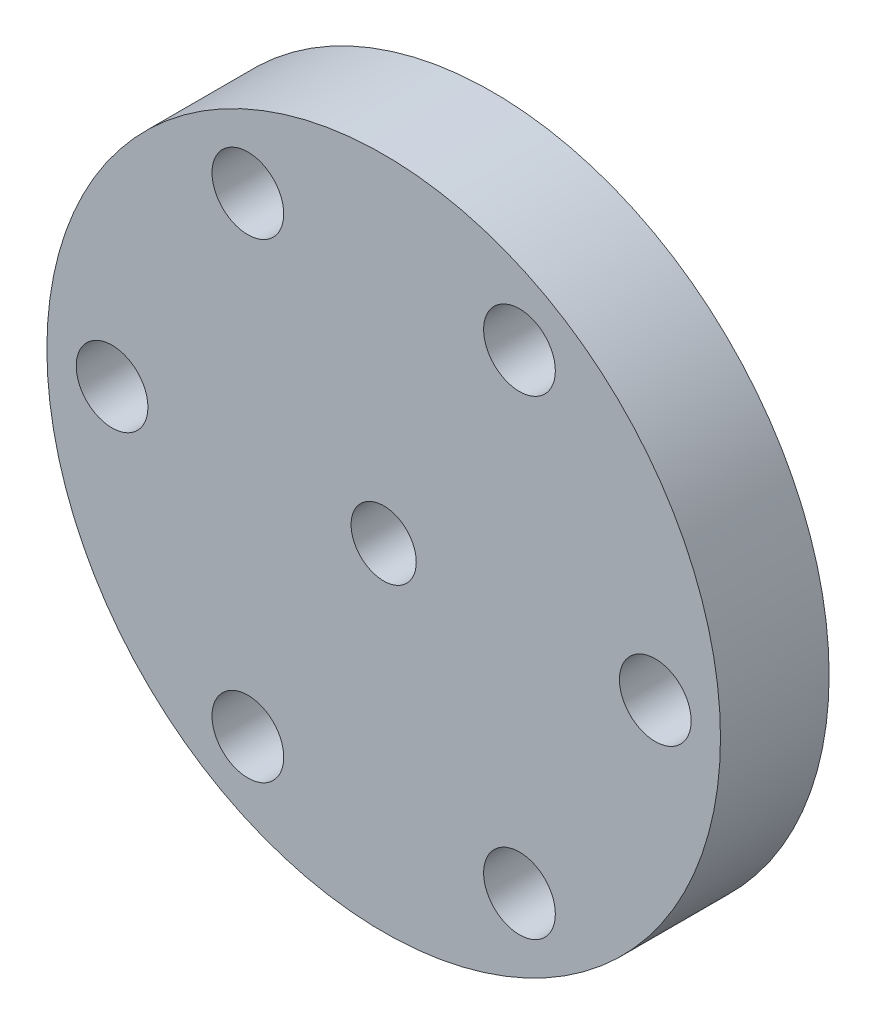
ISO-10303-21;
HEADER;
FILE_DESCRIPTION(('STEP AP214'),'2;1');
FILE_NAME('part.step','',(''),(''),'','','');
FILE_SCHEMA(('AUTOMOTIVE_DESIGN { 1 0 10303 214 1 1 1 1 }'));
ENDSEC;
DATA;
#1=APPLICATION_CONTEXT('core data for automotive mechanical design processes');
#2=APPLICATION_PROTOCOL_DEFINITION('international standard','automotive_design',2000,#1);
#3=PRODUCT_CONTEXT('',#1,'mechanical');
#4=PRODUCT('Part','Part','',(#3));
#5=PRODUCT_RELATED_PRODUCT_CATEGORY('part','',(#4));
#6=PRODUCT_DEFINITION_FORMATION('','',#4);
#7=PRODUCT_DEFINITION_CONTEXT('part definition',#1,'design');
#8=PRODUCT_DEFINITION('design','',#6,#7);
#9=PRODUCT_DEFINITION_SHAPE('','',#8);
#10=(LENGTH_UNIT() NAMED_UNIT(*) SI_UNIT(.MILLI.,.METRE.));
#11=(NAMED_UNIT(*) PLANE_ANGLE_UNIT() SI_UNIT($,.RADIAN.));
#12=(NAMED_UNIT(*) SI_UNIT($,.STERADIAN.) SOLID_ANGLE_UNIT());
#13=UNCERTAINTY_MEASURE_WITH_UNIT(LENGTH_MEASURE(1.E-05),#10,'distance_accuracy_value','');
#14=(GEOMETRIC_REPRESENTATION_CONTEXT(3) GLOBAL_UNCERTAINTY_ASSIGNED_CONTEXT((#13)) GLOBAL_UNIT_ASSIGNED_CONTEXT((#10,
#11,#12)) REPRESENTATION_CONTEXT('',''));
#15=CARTESIAN_POINT('',(0.,0.,0.));
#16=DIRECTION('',(0.,0.,1.));
#17=DIRECTION('',(1.,0.,0.));
#18=AXIS2_PLACEMENT_3D('',#15,#16,#17);
#19=CARTESIAN_POINT('',(0.,0.,5.));
#20=DIRECTION('',(0.,0.,-1.));
#21=DIRECTION('',(-1.,0.,0.));
#22=AXIS2_PLACEMENT_3D('',#19,#20,#21);
#23=PLANE('',#22);
#24=CARTESIAN_POINT('',(0.,0.,5.));
#25=DIRECTION('',(0.,0.,1.));
#26=DIRECTION('',(1.,0.,0.));
#27=AXIS2_PLACEMENT_3D('',#24,#25,#26);
#28=CIRCLE('',#27,3.);
#29=CARTESIAN_POINT('',(3.,0.,5.));
#30=VERTEX_POINT('',#29);
#31=EDGE_CURVE('E45',#30,#30,#28,.T.);
#32=ORIENTED_EDGE('',*,*,#31,.F.);
#33=EDGE_LOOP('',(#32));
#34=FACE_BOUND('',#33,.T.);
#35=CARTESIAN_POINT('',(12.5,21.650635094611,5.));
#36=DIRECTION('',(0.,0.,1.));
#37=DIRECTION('',(1.,0.,0.));
#38=AXIS2_PLACEMENT_3D('',#35,#36,#37);
#39=CIRCLE('',#38,3.3);
#40=CARTESIAN_POINT('',(15.8,21.650635094611,5.));
#41=VERTEX_POINT('',#40);
#42=EDGE_CURVE('E53',#41,#41,#39,.T.);
#43=ORIENTED_EDGE('',*,*,#42,.F.);
#44=EDGE_LOOP('',(#43));
#45=FACE_BOUND('',#44,.T.);
#46=CARTESIAN_POINT('',(-12.5000000000001,21.6506350946109,5.));
#47=DIRECTION('',(0.,0.,1.));
#48=DIRECTION('',(0.499999999999998,0.86602540378444,0.));
#49=AXIS2_PLACEMENT_3D('',#46,#47,#48);
#50=CIRCLE('',#49,3.3);
#51=CARTESIAN_POINT('',(-10.8500000000001,24.5085189270996,5.));
#52=VERTEX_POINT('',#51);
#53=EDGE_CURVE('E61',#52,#52,#50,.T.);
#54=ORIENTED_EDGE('',*,*,#53,.F.);
#55=EDGE_LOOP('',(#54));
#56=FACE_BOUND('',#55,.T.);
#57=CARTESIAN_POINT('',(-25.,-1.16226472890446E-13,5.));
#58=DIRECTION('',(0.,0.,1.));
#59=DIRECTION('',(-0.500000000000004,0.866025403784436,0.));
#60=AXIS2_PLACEMENT_3D('',#57,#58,#59);
#61=CIRCLE('',#60,3.3);
#62=CARTESIAN_POINT('',(-26.65,2.85788383248853,5.));
#63=VERTEX_POINT('',#62);
#64=EDGE_CURVE('E65',#63,#63,#61,.T.);
#65=ORIENTED_EDGE('',*,*,#64,.F.);
#66=EDGE_LOOP('',(#65));
#67=FACE_BOUND('',#66,.T.);
#68=CARTESIAN_POINT('',(-12.5,-21.650635094611,5.));
#69=DIRECTION('',(0.,0.,1.));
#70=DIRECTION('',(-1.,0.,0.));
#71=AXIS2_PLACEMENT_3D('',#68,#69,#70);
#72=CIRCLE('',#71,3.3);
#73=CARTESIAN_POINT('',(-15.8,-21.650635094611,5.));
#74=VERTEX_POINT('',#73);
#75=EDGE_CURVE('E68',#74,#74,#72,.T.);
#76=ORIENTED_EDGE('',*,*,#75,.F.);
#77=EDGE_LOOP('',(#76));
#78=FACE_BOUND('',#77,.T.);
#79=CARTESIAN_POINT('',(12.5000000000002,-21.6506350946108,5.));
#80=DIRECTION('',(0.,0.,1.));
#81=DIRECTION('',(-0.499999999999992,-0.866025403784443,0.));
#82=AXIS2_PLACEMENT_3D('',#79,#80,#81);
#83=CIRCLE('',#82,3.3);
#84=CARTESIAN_POINT('',(10.8500000000002,-24.5085189270995,5.));
#85=VERTEX_POINT('',#84);
#86=EDGE_CURVE('E71',#85,#85,#83,.T.);
#87=ORIENTED_EDGE('',*,*,#86,.F.);
#88=EDGE_LOOP('',(#87));
#89=FACE_BOUND('',#88,.T.);
#90=CARTESIAN_POINT('',(25.,2.9316826744008E-13,5.));
#91=DIRECTION('',(0.,0.,1.));
#92=DIRECTION('',(0.50000000000001,-0.866025403784433,0.));
#93=AXIS2_PLACEMENT_3D('',#90,#91,#92);
#94=CIRCLE('',#93,3.3);
#95=CARTESIAN_POINT('',(26.65,-2.85788383248834,5.));
#96=VERTEX_POINT('',#95);
#97=EDGE_CURVE('E81',#96,#96,#94,.T.);
#98=ORIENTED_EDGE('',*,*,#97,.F.);
#99=EDGE_LOOP('',(#98));
#100=FACE_BOUND('',#99,.T.);
#101=CARTESIAN_POINT('',(0.,0.,5.));
#102=DIRECTION('',(0.,0.,1.));
#103=DIRECTION('',(1.,0.,0.));
#104=AXIS2_PLACEMENT_3D('',#101,#102,#103);
#105=CIRCLE('',#104,31.);
#106=CARTESIAN_POINT('',(31.,0.,5.));
#107=VERTEX_POINT('',#106);
#108=EDGE_CURVE('E104',#107,#107,#105,.T.);
#109=ORIENTED_EDGE('',*,*,#108,.T.);
#110=EDGE_LOOP('',(#109));
#111=FACE_BOUND('',#110,.T.);
#112=ADVANCED_FACE('F37',(#34,#45,#56,#67,#78,#89,#100,#111),#23,.F.);
#113=CARTESIAN_POINT('',(0.,0.,-5.));
#114=DIRECTION('',(0.,0.,-1.));
#115=DIRECTION('',(-1.,0.,0.));
#116=AXIS2_PLACEMENT_3D('',#113,#114,#115);
#117=PLANE('',#116);
#118=CARTESIAN_POINT('',(0.,0.,-5.));
#119=DIRECTION('',(0.,0.,1.));
#120=DIRECTION('',(1.,0.,0.));
#121=AXIS2_PLACEMENT_3D('',#118,#119,#120);
#122=CIRCLE('',#121,3.);
#123=CARTESIAN_POINT('',(3.,0.,-5.));
#124=VERTEX_POINT('',#123);
#125=EDGE_CURVE('E10',#124,#124,#122,.T.);
#126=ORIENTED_EDGE('',*,*,#125,.T.);
#127=EDGE_LOOP('',(#126));
#128=FACE_BOUND('',#127,.T.);
#129=CARTESIAN_POINT('',(12.5,21.650635094611,-5.));
#130=DIRECTION('',(0.,0.,-1.));
#131=DIRECTION('',(-1.,0.,0.));
#132=AXIS2_PLACEMENT_3D('',#129,#130,#131);
#133=CIRCLE('',#132,3.3);
#134=CARTESIAN_POINT('',(9.2,21.650635094611,-5.));
#135=VERTEX_POINT('',#134);
#136=EDGE_CURVE('E50',#135,#135,#133,.T.);
#137=ORIENTED_EDGE('',*,*,#136,.F.);
#138=EDGE_LOOP('',(#137));
#139=FACE_BOUND('',#138,.T.);
#140=CARTESIAN_POINT('',(-12.5000000000001,21.6506350946109,-5.));
#141=DIRECTION('',(0.,0.,-1.));
#142=DIRECTION('',(-1.,0.,0.));
#143=AXIS2_PLACEMENT_3D('',#140,#141,#142);
#144=CIRCLE('',#143,3.3);
#145=CARTESIAN_POINT('',(-15.8000000000001,21.6506350946109,-5.));
#146=VERTEX_POINT('',#145);
#147=EDGE_CURVE('E58',#146,#146,#144,.T.);
#148=ORIENTED_EDGE('',*,*,#147,.F.);
#149=EDGE_LOOP('',(#148));
#150=FACE_BOUND('',#149,.T.);
#151=CARTESIAN_POINT('',(-25.,-1.16226472890446E-13,-5.));
#152=DIRECTION('',(0.,0.,-1.));
#153=DIRECTION('',(-1.,0.,0.));
#154=AXIS2_PLACEMENT_3D('',#151,#152,#153);
#155=CIRCLE('',#154,3.3);
#156=CARTESIAN_POINT('',(-28.3,-1.16226472890446E-13,-5.));
#157=VERTEX_POINT('',#156);
#158=EDGE_CURVE('E62',#157,#157,#155,.T.);
#159=ORIENTED_EDGE('',*,*,#158,.F.);
#160=EDGE_LOOP('',(#159));
#161=FACE_BOUND('',#160,.T.);
#162=CARTESIAN_POINT('',(-12.5,-21.650635094611,-5.));
#163=DIRECTION('',(0.,0.,-1.));
#164=DIRECTION('',(-1.,0.,0.));
#165=AXIS2_PLACEMENT_3D('',#162,#163,#164);
#166=CIRCLE('',#165,3.3);
#167=CARTESIAN_POINT('',(-15.8,-21.650635094611,-5.));
#168=VERTEX_POINT('',#167);
#169=EDGE_CURVE('E66',#168,#168,#166,.T.);
#170=ORIENTED_EDGE('',*,*,#169,.F.);
#171=EDGE_LOOP('',(#170));
#172=FACE_BOUND('',#171,.T.);
#173=CARTESIAN_POINT('',(12.5000000000002,-21.6506350946108,-5.));
#174=DIRECTION('',(0.,0.,-1.));
#175=DIRECTION('',(-1.,0.,0.));
#176=AXIS2_PLACEMENT_3D('',#173,#174,#175);
#177=CIRCLE('',#176,3.3);
#178=CARTESIAN_POINT('',(9.2000000000002,-21.6506350946108,-5.));
#179=VERTEX_POINT('',#178);
#180=EDGE_CURVE('E69',#179,#179,#177,.T.);
#181=ORIENTED_EDGE('',*,*,#180,.F.);
#182=EDGE_LOOP('',(#181));
#183=FACE_BOUND('',#182,.T.);
#184=CARTESIAN_POINT('',(25.,2.9316826744008E-13,-5.));
#185=DIRECTION('',(0.,0.,-1.));
#186=DIRECTION('',(-1.,0.,0.));
#187=AXIS2_PLACEMENT_3D('',#184,#185,#186);
#188=CIRCLE('',#187,3.3);
#189=CARTESIAN_POINT('',(21.7,2.9316826744008E-13,-5.));
#190=VERTEX_POINT('',#189);
#191=EDGE_CURVE('E41',#190,#190,#188,.T.);
#192=ORIENTED_EDGE('',*,*,#191,.F.);
#193=EDGE_LOOP('',(#192));
#194=FACE_BOUND('',#193,.T.);
#195=CARTESIAN_POINT('',(0.,0.,-5.));
#196=DIRECTION('',(0.,0.,1.));
#197=DIRECTION('',(1.,0.,0.));
#198=AXIS2_PLACEMENT_3D('',#195,#196,#197);
#199=CIRCLE('',#198,31.);
#200=CARTESIAN_POINT('',(31.,0.,-5.));
#201=VERTEX_POINT('',#200);
#202=EDGE_CURVE('E106',#201,#201,#199,.T.);
#203=ORIENTED_EDGE('',*,*,#202,.F.);
#204=EDGE_LOOP('',(#203));
#205=FACE_BOUND('',#204,.T.);
#206=ADVANCED_FACE('F39',(#128,#139,#150,#161,#172,#183,#194,#205),#117,.T.);
#207=CARTESIAN_POINT('',(0.,0.,-5.));
#208=DIRECTION('',(0.,0.,1.));
#209=DIRECTION('',(1.,0.,0.));
#210=AXIS2_PLACEMENT_3D('',#207,#208,#209);
#211=CYLINDRICAL_SURFACE('',#210,3.);
#212=ORIENTED_EDGE('',*,*,#125,.F.);
#213=EDGE_LOOP('',(#212));
#214=FACE_BOUND('',#213,.T.);
#215=ORIENTED_EDGE('',*,*,#31,.T.);
#216=EDGE_LOOP('',(#215));
#217=FACE_BOUND('',#216,.T.);
#218=ADVANCED_FACE('F139',(#214,#217),#211,.F.);
#219=CARTESIAN_POINT('',(12.5,21.650635094611,-29.5));
#220=DIRECTION('',(0.,0.,1.));
#221=DIRECTION('',(1.,0.,0.));
#222=AXIS2_PLACEMENT_3D('',#219,#220,#221);
#223=CYLINDRICAL_SURFACE('',#222,3.3);
#224=ORIENTED_EDGE('',*,*,#136,.T.);
#225=EDGE_LOOP('',(#224));
#226=FACE_BOUND('',#225,.T.);
#227=ORIENTED_EDGE('',*,*,#42,.T.);
#228=EDGE_LOOP('',(#227));
#229=FACE_BOUND('',#228,.T.);
#230=ADVANCED_FACE('F135',(#226,#229),#223,.F.);
#231=CARTESIAN_POINT('',(-12.5000000000001,21.6506350946109,-29.5));
#232=DIRECTION('',(0.,0.,1.));
#233=DIRECTION('',(1.,0.,0.));
#234=AXIS2_PLACEMENT_3D('',#231,#232,#233);
#235=CYLINDRICAL_SURFACE('',#234,3.3);
#236=ORIENTED_EDGE('',*,*,#147,.T.);
#237=EDGE_LOOP('',(#236));
#238=FACE_BOUND('',#237,.T.);
#239=ORIENTED_EDGE('',*,*,#53,.T.);
#240=EDGE_LOOP('',(#239));
#241=FACE_BOUND('',#240,.T.);
#242=ADVANCED_FACE('F89',(#238,#241),#235,.F.);
#243=CARTESIAN_POINT('',(-25.,-1.16226472890446E-13,-29.5));
#244=DIRECTION('',(0.,0.,1.));
#245=DIRECTION('',(1.,0.,0.));
#246=AXIS2_PLACEMENT_3D('',#243,#244,#245);
#247=CYLINDRICAL_SURFACE('',#246,3.3);
#248=ORIENTED_EDGE('',*,*,#158,.T.);
#249=EDGE_LOOP('',(#248));
#250=FACE_BOUND('',#249,.T.);
#251=ORIENTED_EDGE('',*,*,#64,.T.);
#252=EDGE_LOOP('',(#251));
#253=FACE_BOUND('',#252,.T.);
#254=ADVANCED_FACE('F128',(#250,#253),#247,.F.);
#255=CARTESIAN_POINT('',(-12.5,-21.650635094611,-29.5));
#256=DIRECTION('',(0.,0.,1.));
#257=DIRECTION('',(1.,0.,0.));
#258=AXIS2_PLACEMENT_3D('',#255,#256,#257);
#259=CYLINDRICAL_SURFACE('',#258,3.3);
#260=ORIENTED_EDGE('',*,*,#169,.T.);
#261=EDGE_LOOP('',(#260));
#262=FACE_BOUND('',#261,.T.);
#263=ORIENTED_EDGE('',*,*,#75,.T.);
#264=EDGE_LOOP('',(#263));
#265=FACE_BOUND('',#264,.T.);
#266=ADVANCED_FACE('F123',(#262,#265),#259,.F.);
#267=CARTESIAN_POINT('',(12.5000000000002,-21.6506350946108,-29.5));
#268=DIRECTION('',(0.,0.,1.));
#269=DIRECTION('',(1.,0.,0.));
#270=AXIS2_PLACEMENT_3D('',#267,#268,#269);
#271=CYLINDRICAL_SURFACE('',#270,3.3);
#272=ORIENTED_EDGE('',*,*,#180,.T.);
#273=EDGE_LOOP('',(#272));
#274=FACE_BOUND('',#273,.T.);
#275=ORIENTED_EDGE('',*,*,#86,.T.);
#276=EDGE_LOOP('',(#275));
#277=FACE_BOUND('',#276,.T.);
#278=ADVANCED_FACE('F115',(#274,#277),#271,.F.);
#279=CARTESIAN_POINT('',(25.,2.9316826744008E-13,-29.5));
#280=DIRECTION('',(0.,0.,1.));
#281=DIRECTION('',(1.,0.,0.));
#282=AXIS2_PLACEMENT_3D('',#279,#280,#281);
#283=CYLINDRICAL_SURFACE('',#282,3.3);
#284=ORIENTED_EDGE('',*,*,#191,.T.);
#285=EDGE_LOOP('',(#284));
#286=FACE_BOUND('',#285,.T.);
#287=ORIENTED_EDGE('',*,*,#97,.T.);
#288=EDGE_LOOP('',(#287));
#289=FACE_BOUND('',#288,.T.);
#290=ADVANCED_FACE('F112',(#286,#289),#283,.F.);
#291=CARTESIAN_POINT('',(0.,0.,-5.));
#292=DIRECTION('',(0.,0.,1.));
#293=DIRECTION('',(1.,0.,0.));
#294=AXIS2_PLACEMENT_3D('',#291,#292,#293);
#295=CYLINDRICAL_SURFACE('',#294,31.);
#296=ORIENTED_EDGE('',*,*,#202,.T.);
#297=EDGE_LOOP('',(#296));
#298=FACE_BOUND('',#297,.T.);
#299=ORIENTED_EDGE('',*,*,#108,.F.);
#300=EDGE_LOOP('',(#299));
#301=FACE_BOUND('',#300,.T.);
#302=ADVANCED_FACE('F114',(#298,#301),#295,.T.);
#303=CLOSED_SHELL('',(#112,#206,#218,#230,#242,#254,#266,#278,#290,#302));
#304=MANIFOLD_SOLID_BREP('B2',#303);
#305=ADVANCED_BREP_SHAPE_REPRESENTATION('',(#18,#304),#14);
#306=SHAPE_DEFINITION_REPRESENTATION(#9,#305);
ENDSEC;
END-ISO-10303-21;
